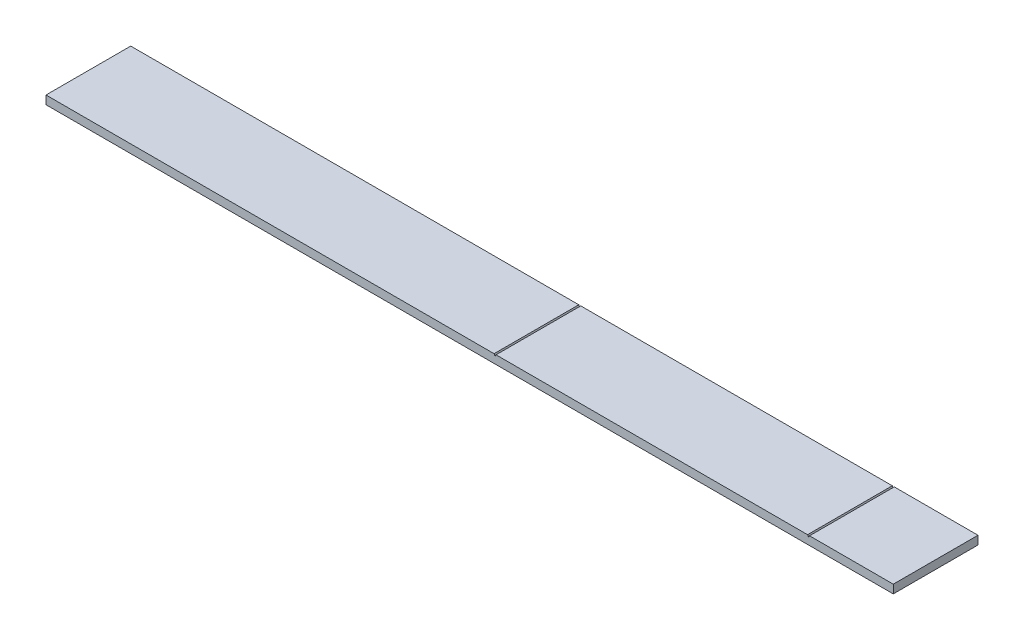
ISO-10303-21;
HEADER;
FILE_DESCRIPTION(('STEP AP214'),'2;1');
FILE_NAME('part.step','',(''),(''),'','','');
FILE_SCHEMA(('AUTOMOTIVE_DESIGN { 1 0 10303 214 1 1 1 1 }'));
ENDSEC;
DATA;
#1=APPLICATION_CONTEXT('core data for automotive mechanical design processes');
#2=APPLICATION_PROTOCOL_DEFINITION('international standard','automotive_design',2000,#1);
#3=PRODUCT_CONTEXT('',#1,'mechanical');
#4=PRODUCT('Part','Part','',(#3));
#5=PRODUCT_RELATED_PRODUCT_CATEGORY('part','',(#4));
#6=PRODUCT_DEFINITION_FORMATION('','',#4);
#7=PRODUCT_DEFINITION_CONTEXT('part definition',#1,'design');
#8=PRODUCT_DEFINITION('design','',#6,#7);
#9=PRODUCT_DEFINITION_SHAPE('','',#8);
#10=(LENGTH_UNIT() NAMED_UNIT(*) SI_UNIT(.MILLI.,.METRE.));
#11=(NAMED_UNIT(*) PLANE_ANGLE_UNIT() SI_UNIT($,.RADIAN.));
#12=(NAMED_UNIT(*) SI_UNIT($,.STERADIAN.) SOLID_ANGLE_UNIT());
#13=UNCERTAINTY_MEASURE_WITH_UNIT(LENGTH_MEASURE(1.E-05),#10,'distance_accuracy_value','');
#14=(GEOMETRIC_REPRESENTATION_CONTEXT(3) GLOBAL_UNCERTAINTY_ASSIGNED_CONTEXT((#13)) GLOBAL_UNIT_ASSIGNED_CONTEXT((#10,
#11,#12)) REPRESENTATION_CONTEXT('',''));
#15=CARTESIAN_POINT('',(0.,0.,0.));
#16=DIRECTION('',(0.,0.,1.));
#17=DIRECTION('',(1.,0.,0.));
#18=AXIS2_PLACEMENT_3D('',#15,#16,#17);
#19=CARTESIAN_POINT('',(0.,0.,100.));
#20=DIRECTION('',(1.,0.,0.));
#21=DIRECTION('',(0.,1.,0.));
#22=AXIS2_PLACEMENT_3D('',#19,#20,#21);
#23=PLANE('',#22);
#24=DIRECTION('',(0.,-1.,0.));
#25=VECTOR('',#24,1.);
#26=CARTESIAN_POINT('',(0.,0.,0.));
#27=LINE('',#26,#25);
#28=CARTESIAN_POINT('',(0.,0.,0.));
#29=VERTEX_POINT('',#28);
#30=CARTESIAN_POINT('',(0.,-10.,0.));
#31=VERTEX_POINT('',#30);
#32=EDGE_CURVE('E143',#29,#31,#27,.T.);
#33=ORIENTED_EDGE('',*,*,#32,.T.);
#34=DIRECTION('',(0.,0.,-1.));
#35=VECTOR('',#34,1.);
#36=CARTESIAN_POINT('',(0.,-10.,100.));
#37=LINE('',#36,#35);
#38=CARTESIAN_POINT('',(0.,-10.,100.));
#39=VERTEX_POINT('',#38);
#40=EDGE_CURVE('E11',#39,#31,#37,.T.);
#41=ORIENTED_EDGE('',*,*,#40,.F.);
#42=DIRECTION('',(0.,-1.,0.));
#43=VECTOR('',#42,1.);
#44=CARTESIAN_POINT('',(0.,0.,100.));
#45=LINE('',#44,#43);
#46=CARTESIAN_POINT('',(0.,0.,100.));
#47=VERTEX_POINT('',#46);
#48=EDGE_CURVE('E161',#47,#39,#45,.T.);
#49=ORIENTED_EDGE('',*,*,#48,.F.);
#50=DIRECTION('',(0.,0.,-1.));
#51=VECTOR('',#50,1.);
#52=CARTESIAN_POINT('',(0.,0.,100.));
#53=LINE('',#52,#51);
#54=EDGE_CURVE('E139',#47,#29,#53,.T.);
#55=ORIENTED_EDGE('',*,*,#54,.T.);
#56=EDGE_LOOP('',(#33,#41,#49,#55));
#57=FACE_BOUND('',#56,.T.);
#58=ADVANCED_FACE('F35',(#57),#23,.F.);
#59=CARTESIAN_POINT('',(0.,-10.,100.));
#60=DIRECTION('',(0.,1.,0.));
#61=DIRECTION('',(-1.,0.,0.));
#62=AXIS2_PLACEMENT_3D('',#59,#60,#61);
#63=PLANE('',#62);
#64=DIRECTION('',(1.,0.,0.));
#65=VECTOR('',#64,1.);
#66=CARTESIAN_POINT('',(0.,-10.,0.));
#67=LINE('',#66,#65);
#68=CARTESIAN_POINT('',(1000.,-10.,0.));
#69=VERTEX_POINT('',#68);
#70=EDGE_CURVE('E146',#31,#69,#67,.T.);
#71=ORIENTED_EDGE('',*,*,#70,.T.);
#72=DIRECTION('',(0.,0.,-1.));
#73=VECTOR('',#72,1.);
#74=CARTESIAN_POINT('',(1000.,-10.,100.));
#75=LINE('',#74,#73);
#76=CARTESIAN_POINT('',(1000.,-10.,100.));
#77=VERTEX_POINT('',#76);
#78=EDGE_CURVE('E43',#77,#69,#75,.T.);
#79=ORIENTED_EDGE('',*,*,#78,.F.);
#80=DIRECTION('',(1.,0.,0.));
#81=VECTOR('',#80,1.);
#82=CARTESIAN_POINT('',(0.,-10.,100.));
#83=LINE('',#82,#81);
#84=EDGE_CURVE('E100',#39,#77,#83,.T.);
#85=ORIENTED_EDGE('',*,*,#84,.F.);
#86=ORIENTED_EDGE('',*,*,#40,.T.);
#87=EDGE_LOOP('',(#71,#79,#85,#86));
#88=FACE_BOUND('',#87,.T.);
#89=ADVANCED_FACE('F210',(#88),#63,.F.);
#90=CARTESIAN_POINT('',(1000.,0.,100.));
#91=DIRECTION('',(-1.,0.,0.));
#92=DIRECTION('',(0.,0.,1.));
#93=AXIS2_PLACEMENT_3D('',#90,#91,#92);
#94=PLANE('',#93);
#95=DIRECTION('',(0.,1.,0.));
#96=VECTOR('',#95,1.);
#97=CARTESIAN_POINT('',(1000.,0.,0.));
#98=LINE('',#97,#96);
#99=CARTESIAN_POINT('',(1000.,0.,0.));
#100=VERTEX_POINT('',#99);
#101=EDGE_CURVE('E148',#69,#100,#98,.T.);
#102=ORIENTED_EDGE('',*,*,#101,.T.);
#103=DIRECTION('',(0.,0.,-1.));
#104=VECTOR('',#103,1.);
#105=CARTESIAN_POINT('',(1000.,0.,100.));
#106=LINE('',#105,#104);
#107=CARTESIAN_POINT('',(1000.,0.,100.));
#108=VERTEX_POINT('',#107);
#109=EDGE_CURVE('E174',#108,#100,#106,.T.);
#110=ORIENTED_EDGE('',*,*,#109,.F.);
#111=DIRECTION('',(0.,1.,0.));
#112=VECTOR('',#111,1.);
#113=CARTESIAN_POINT('',(1000.,0.,100.));
#114=LINE('',#113,#112);
#115=EDGE_CURVE('E182',#77,#108,#114,.T.);
#116=ORIENTED_EDGE('',*,*,#115,.F.);
#117=ORIENTED_EDGE('',*,*,#78,.T.);
#118=EDGE_LOOP('',(#102,#110,#116,#117));
#119=FACE_BOUND('',#118,.T.);
#120=ADVANCED_FACE('F180',(#119),#94,.F.);
#121=CARTESIAN_POINT('',(901.154700538379,0.,100.));
#122=DIRECTION('',(0.,-1.,0.));
#123=DIRECTION('',(0.,0.,-1.));
#124=AXIS2_PLACEMENT_3D('',#121,#122,#123);
#125=PLANE('',#124);
#126=DIRECTION('',(-1.,0.,0.));
#127=VECTOR('',#126,1.);
#128=CARTESIAN_POINT('',(901.154700538379,0.,0.));
#129=LINE('',#128,#127);
#130=CARTESIAN_POINT('',(901.154700538379,0.,0.));
#131=VERTEX_POINT('',#130);
#132=EDGE_CURVE('E150',#100,#131,#129,.T.);
#133=ORIENTED_EDGE('',*,*,#132,.T.);
#134=DIRECTION('',(0.,0.,-1.));
#135=VECTOR('',#134,1.);
#136=CARTESIAN_POINT('',(901.154700538379,0.,100.));
#137=LINE('',#136,#135);
#138=CARTESIAN_POINT('',(901.154700538379,0.,100.));
#139=VERTEX_POINT('',#138);
#140=EDGE_CURVE('E171',#139,#131,#137,.T.);
#141=ORIENTED_EDGE('',*,*,#140,.F.);
#142=DIRECTION('',(-1.,0.,0.));
#143=VECTOR('',#142,1.);
#144=CARTESIAN_POINT('',(901.154700538379,0.,100.));
#145=LINE('',#144,#143);
#146=EDGE_CURVE('E200',#108,#139,#145,.T.);
#147=ORIENTED_EDGE('',*,*,#146,.F.);
#148=ORIENTED_EDGE('',*,*,#109,.T.);
#149=EDGE_LOOP('',(#133,#141,#147,#148));
#150=FACE_BOUND('',#149,.T.);
#151=ADVANCED_FACE('F191',(#150),#125,.F.);
#152=CARTESIAN_POINT('',(900.,-2.,100.));
#153=DIRECTION('',(0.866025403784431,-0.500000000000014,0.));
#154=DIRECTION('',(0.500000000000014,0.866025403784431,0.));
#155=AXIS2_PLACEMENT_3D('',#152,#153,#154);
#156=PLANE('',#155);
#157=DIRECTION('',(-0.500000000000014,-0.866025403784431,0.));
#158=VECTOR('',#157,1.);
#159=CARTESIAN_POINT('',(900.,-2.,0.));
#160=LINE('',#159,#158);
#161=CARTESIAN_POINT('',(900.,-2.,0.));
#162=VERTEX_POINT('',#161);
#163=EDGE_CURVE('E152',#131,#162,#160,.T.);
#164=ORIENTED_EDGE('',*,*,#163,.T.);
#165=DIRECTION('',(0.,0.,-1.));
#166=VECTOR('',#165,1.);
#167=CARTESIAN_POINT('',(900.,-2.,100.));
#168=LINE('',#167,#166);
#169=CARTESIAN_POINT('',(900.,-2.,100.));
#170=VERTEX_POINT('',#169);
#171=EDGE_CURVE('E168',#170,#162,#168,.T.);
#172=ORIENTED_EDGE('',*,*,#171,.F.);
#173=DIRECTION('',(-0.500000000000014,-0.866025403784431,0.));
#174=VECTOR('',#173,1.);
#175=CARTESIAN_POINT('',(900.,-2.,100.));
#176=LINE('',#175,#174);
#177=EDGE_CURVE('E197',#139,#170,#176,.T.);
#178=ORIENTED_EDGE('',*,*,#177,.F.);
#179=ORIENTED_EDGE('',*,*,#140,.T.);
#180=EDGE_LOOP('',(#164,#172,#178,#179));
#181=FACE_BOUND('',#180,.T.);
#182=ADVANCED_FACE('F195',(#181),#156,.F.);
#183=CARTESIAN_POINT('',(898.845299461621,0.,100.));
#184=DIRECTION('',(-0.866025403784431,-0.500000000000014,0.));
#185=DIRECTION('',(0.500000000000014,-0.866025403784431,0.));
#186=AXIS2_PLACEMENT_3D('',#183,#184,#185);
#187=PLANE('',#186);
#188=DIRECTION('',(-0.500000000000014,0.866025403784431,0.));
#189=VECTOR('',#188,1.);
#190=CARTESIAN_POINT('',(898.845299461621,0.,0.));
#191=LINE('',#190,#189);
#192=CARTESIAN_POINT('',(898.845299461621,0.,0.));
#193=VERTEX_POINT('',#192);
#194=EDGE_CURVE('E154',#162,#193,#191,.T.);
#195=ORIENTED_EDGE('',*,*,#194,.T.);
#196=DIRECTION('',(0.,0.,-1.));
#197=VECTOR('',#196,1.);
#198=CARTESIAN_POINT('',(898.845299461621,0.,100.));
#199=LINE('',#198,#197);
#200=CARTESIAN_POINT('',(898.845299461621,0.,100.));
#201=VERTEX_POINT('',#200);
#202=EDGE_CURVE('E165',#201,#193,#199,.T.);
#203=ORIENTED_EDGE('',*,*,#202,.F.);
#204=DIRECTION('',(-0.500000000000014,0.866025403784431,0.));
#205=VECTOR('',#204,1.);
#206=CARTESIAN_POINT('',(898.845299461621,0.,100.));
#207=LINE('',#206,#205);
#208=EDGE_CURVE('E199',#170,#201,#207,.T.);
#209=ORIENTED_EDGE('',*,*,#208,.F.);
#210=ORIENTED_EDGE('',*,*,#171,.T.);
#211=EDGE_LOOP('',(#195,#203,#209,#210));
#212=FACE_BOUND('',#211,.T.);
#213=ADVANCED_FACE('F222',(#212),#187,.F.);
#214=CARTESIAN_POINT('',(531.154700538379,0.,100.));
#215=DIRECTION('',(0.,-1.,0.));
#216=DIRECTION('',(0.,0.,-1.));
#217=AXIS2_PLACEMENT_3D('',#214,#215,#216);
#218=PLANE('',#217);
#219=DIRECTION('',(-1.,0.,0.));
#220=VECTOR('',#219,1.);
#221=CARTESIAN_POINT('',(531.154700538379,0.,0.));
#222=LINE('',#221,#220);
#223=CARTESIAN_POINT('',(531.154700538379,0.,0.));
#224=VERTEX_POINT('',#223);
#225=EDGE_CURVE('E156',#193,#224,#222,.T.);
#226=ORIENTED_EDGE('',*,*,#225,.T.);
#227=DIRECTION('',(0.,0.,-1.));
#228=VECTOR('',#227,1.);
#229=CARTESIAN_POINT('',(531.154700538379,0.,100.));
#230=LINE('',#229,#228);
#231=CARTESIAN_POINT('',(531.154700538379,0.,100.));
#232=VERTEX_POINT('',#231);
#233=EDGE_CURVE('E134',#232,#224,#230,.T.);
#234=ORIENTED_EDGE('',*,*,#233,.F.);
#235=DIRECTION('',(-1.,0.,0.));
#236=VECTOR('',#235,1.);
#237=CARTESIAN_POINT('',(531.154700538379,0.,100.));
#238=LINE('',#237,#236);
#239=EDGE_CURVE('E125',#201,#232,#238,.T.);
#240=ORIENTED_EDGE('',*,*,#239,.F.);
#241=ORIENTED_EDGE('',*,*,#202,.T.);
#242=EDGE_LOOP('',(#226,#234,#240,#241));
#243=FACE_BOUND('',#242,.T.);
#244=ADVANCED_FACE('F225',(#243),#218,.F.);
#245=CARTESIAN_POINT('',(530.,-2.,100.));
#246=DIRECTION('',(0.866025403784431,-0.500000000000014,0.));
#247=DIRECTION('',(0.500000000000014,0.866025403784431,0.));
#248=AXIS2_PLACEMENT_3D('',#245,#246,#247);
#249=PLANE('',#248);
#250=DIRECTION('',(-0.500000000000014,-0.866025403784431,0.));
#251=VECTOR('',#250,1.);
#252=CARTESIAN_POINT('',(530.,-2.,0.));
#253=LINE('',#252,#251);
#254=CARTESIAN_POINT('',(530.,-2.,0.));
#255=VERTEX_POINT('',#254);
#256=EDGE_CURVE('E133',#224,#255,#253,.T.);
#257=ORIENTED_EDGE('',*,*,#256,.T.);
#258=DIRECTION('',(0.,0.,-1.));
#259=VECTOR('',#258,1.);
#260=CARTESIAN_POINT('',(530.,-2.,100.));
#261=LINE('',#260,#259);
#262=CARTESIAN_POINT('',(530.,-2.,100.));
#263=VERTEX_POINT('',#262);
#264=EDGE_CURVE('E130',#263,#255,#261,.T.);
#265=ORIENTED_EDGE('',*,*,#264,.F.);
#266=DIRECTION('',(-0.500000000000014,-0.866025403784431,0.));
#267=VECTOR('',#266,1.);
#268=CARTESIAN_POINT('',(530.,-2.,100.));
#269=LINE('',#268,#267);
#270=EDGE_CURVE('E119',#232,#263,#269,.T.);
#271=ORIENTED_EDGE('',*,*,#270,.F.);
#272=ORIENTED_EDGE('',*,*,#233,.T.);
#273=EDGE_LOOP('',(#257,#265,#271,#272));
#274=FACE_BOUND('',#273,.T.);
#275=ADVANCED_FACE('F131',(#274),#249,.F.);
#276=CARTESIAN_POINT('',(528.845299461621,0.,100.));
#277=DIRECTION('',(-0.866025403784452,-0.499999999999978,0.));
#278=DIRECTION('',(0.499999999999978,-0.866025403784452,0.));
#279=AXIS2_PLACEMENT_3D('',#276,#277,#278);
#280=PLANE('',#279);
#281=DIRECTION('',(-0.499999999999978,0.866025403784451,0.));
#282=VECTOR('',#281,1.);
#283=CARTESIAN_POINT('',(528.845299461621,0.,0.));
#284=LINE('',#283,#282);
#285=CARTESIAN_POINT('',(528.845299461621,0.,0.));
#286=VERTEX_POINT('',#285);
#287=EDGE_CURVE('E86',#255,#286,#284,.T.);
#288=ORIENTED_EDGE('',*,*,#287,.T.);
#289=DIRECTION('',(0.,0.,-1.));
#290=VECTOR('',#289,1.);
#291=CARTESIAN_POINT('',(528.845299461621,0.,100.));
#292=LINE('',#291,#290);
#293=CARTESIAN_POINT('',(528.845299461621,0.,100.));
#294=VERTEX_POINT('',#293);
#295=EDGE_CURVE('E135',#294,#286,#292,.T.);
#296=ORIENTED_EDGE('',*,*,#295,.F.);
#297=DIRECTION('',(-0.499999999999978,0.866025403784451,0.));
#298=VECTOR('',#297,1.);
#299=CARTESIAN_POINT('',(528.845299461621,0.,100.));
#300=LINE('',#299,#298);
#301=EDGE_CURVE('E123',#263,#294,#300,.T.);
#302=ORIENTED_EDGE('',*,*,#301,.F.);
#303=ORIENTED_EDGE('',*,*,#264,.T.);
#304=EDGE_LOOP('',(#288,#296,#302,#303));
#305=FACE_BOUND('',#304,.T.);
#306=ADVANCED_FACE('F137',(#305),#280,.F.);
#307=CARTESIAN_POINT('',(0.,0.,100.));
#308=DIRECTION('',(0.,-1.,0.));
#309=DIRECTION('',(0.,0.,-1.));
#310=AXIS2_PLACEMENT_3D('',#307,#308,#309);
#311=PLANE('',#310);
#312=DIRECTION('',(-1.,0.,0.));
#313=VECTOR('',#312,1.);
#314=CARTESIAN_POINT('',(0.,0.,0.));
#315=LINE('',#314,#313);
#316=EDGE_CURVE('E92',#286,#29,#315,.T.);
#317=ORIENTED_EDGE('',*,*,#316,.T.);
#318=ORIENTED_EDGE('',*,*,#54,.F.);
#319=DIRECTION('',(-1.,0.,0.));
#320=VECTOR('',#319,1.);
#321=CARTESIAN_POINT('',(0.,0.,100.));
#322=LINE('',#321,#320);
#323=EDGE_CURVE('E51',#294,#47,#322,.T.);
#324=ORIENTED_EDGE('',*,*,#323,.F.);
#325=ORIENTED_EDGE('',*,*,#295,.T.);
#326=EDGE_LOOP('',(#317,#318,#324,#325));
#327=FACE_BOUND('',#326,.T.);
#328=ADVANCED_FACE('F234',(#327),#311,.F.);
#329=CARTESIAN_POINT('',(0.,0.,100.));
#330=DIRECTION('',(0.,0.,1.));
#331=DIRECTION('',(1.,0.,0.));
#332=AXIS2_PLACEMENT_3D('',#329,#330,#331);
#333=PLANE('',#332);
#334=ORIENTED_EDGE('',*,*,#48,.T.);
#335=ORIENTED_EDGE('',*,*,#84,.T.);
#336=ORIENTED_EDGE('',*,*,#115,.T.);
#337=ORIENTED_EDGE('',*,*,#146,.T.);
#338=ORIENTED_EDGE('',*,*,#177,.T.);
#339=ORIENTED_EDGE('',*,*,#208,.T.);
#340=ORIENTED_EDGE('',*,*,#239,.T.);
#341=ORIENTED_EDGE('',*,*,#270,.T.);
#342=ORIENTED_EDGE('',*,*,#301,.T.);
#343=ORIENTED_EDGE('',*,*,#323,.T.);
#344=EDGE_LOOP('',(#334,#335,#336,#337,#338,#339,#340,#341,#342,#343));
#345=FACE_BOUND('',#344,.T.);
#346=ADVANCED_FACE('F121',(#345),#333,.T.);
#347=CARTESIAN_POINT('',(0.,0.,0.));
#348=DIRECTION('',(0.,0.,1.));
#349=DIRECTION('',(1.,0.,0.));
#350=AXIS2_PLACEMENT_3D('',#347,#348,#349);
#351=PLANE('',#350);
#352=ORIENTED_EDGE('',*,*,#32,.F.);
#353=ORIENTED_EDGE('',*,*,#316,.F.);
#354=ORIENTED_EDGE('',*,*,#287,.F.);
#355=ORIENTED_EDGE('',*,*,#256,.F.);
#356=ORIENTED_EDGE('',*,*,#225,.F.);
#357=ORIENTED_EDGE('',*,*,#194,.F.);
#358=ORIENTED_EDGE('',*,*,#163,.F.);
#359=ORIENTED_EDGE('',*,*,#132,.F.);
#360=ORIENTED_EDGE('',*,*,#101,.F.);
#361=ORIENTED_EDGE('',*,*,#70,.F.);
#362=EDGE_LOOP('',(#352,#353,#354,#355,#356,#357,#358,#359,#360,#361));
#363=FACE_BOUND('',#362,.T.);
#364=ADVANCED_FACE('F186',(#363),#351,.F.);
#365=CLOSED_SHELL('',(#58,#89,#120,#151,#182,#213,#244,#275,#306,#328,#346,#364));
#366=MANIFOLD_SOLID_BREP('B2',#365);
#367=ADVANCED_BREP_SHAPE_REPRESENTATION('',(#18,#366),#14);
#368=SHAPE_DEFINITION_REPRESENTATION(#9,#367);
ENDSEC;
END-ISO-10303-21;
